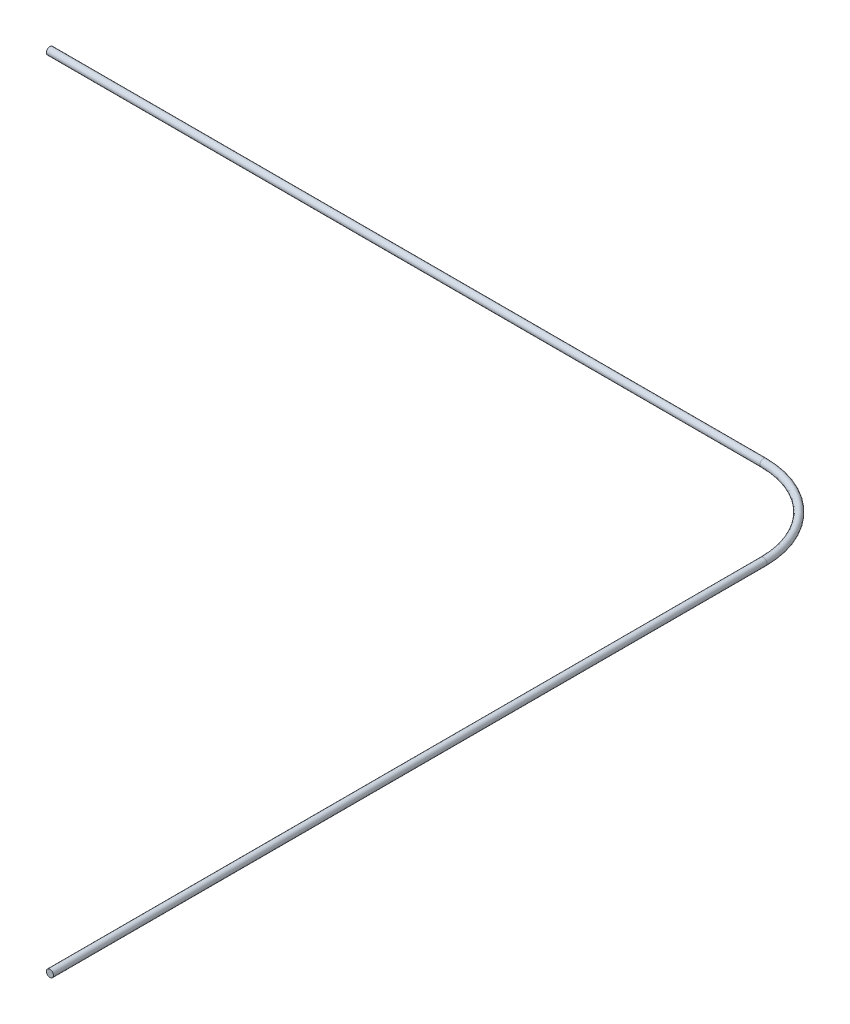
ISO-10303-21;
HEADER;
FILE_DESCRIPTION(('STEP AP214'),'2;1');
FILE_NAME('part.step','',(''),(''),'','','');
FILE_SCHEMA(('AUTOMOTIVE_DESIGN { 1 0 10303 214 1 1 1 1 }'));
ENDSEC;
DATA;
#1=APPLICATION_CONTEXT('core data for automotive mechanical design processes');
#2=APPLICATION_PROTOCOL_DEFINITION('international standard','automotive_design',2000,#1);
#3=PRODUCT_CONTEXT('',#1,'mechanical');
#4=PRODUCT('Part','Part','',(#3));
#5=PRODUCT_RELATED_PRODUCT_CATEGORY('part','',(#4));
#6=PRODUCT_DEFINITION_FORMATION('','',#4);
#7=PRODUCT_DEFINITION_CONTEXT('part definition',#1,'design');
#8=PRODUCT_DEFINITION('design','',#6,#7);
#9=PRODUCT_DEFINITION_SHAPE('','',#8);
#10=(LENGTH_UNIT() NAMED_UNIT(*) SI_UNIT(.MILLI.,.METRE.));
#11=(NAMED_UNIT(*) PLANE_ANGLE_UNIT() SI_UNIT($,.RADIAN.));
#12=(NAMED_UNIT(*) SI_UNIT($,.STERADIAN.) SOLID_ANGLE_UNIT());
#13=UNCERTAINTY_MEASURE_WITH_UNIT(LENGTH_MEASURE(1.E-05),#10,'distance_accuracy_value','');
#14=(GEOMETRIC_REPRESENTATION_CONTEXT(3) GLOBAL_UNCERTAINTY_ASSIGNED_CONTEXT((#13)) GLOBAL_UNIT_ASSIGNED_CONTEXT((#10,
#11,#12)) REPRESENTATION_CONTEXT('',''));
#15=CARTESIAN_POINT('',(0.,0.,0.));
#16=DIRECTION('',(0.,0.,1.));
#17=DIRECTION('',(1.,0.,0.));
#18=AXIS2_PLACEMENT_3D('',#15,#16,#17);
#19=CARTESIAN_POINT('',(-50.,0.,-6.));
#20=DIRECTION('',(-1.,0.,0.));
#21=DIRECTION('',(0.,0.,1.));
#22=AXIS2_PLACEMENT_3D('',#19,#20,#21);
#23=PLANE('',#22);
#24=CARTESIAN_POINT('',(-50.,0.,-6.));
#25=DIRECTION('',(-1.,0.,0.));
#26=DIRECTION('',(0.,0.,1.));
#27=AXIS2_PLACEMENT_3D('',#24,#25,#26);
#28=CIRCLE('',#27,0.25);
#29=CARTESIAN_POINT('',(-50.,0.,-5.75));
#30=VERTEX_POINT('',#29);
#31=EDGE_CURVE('E63',#30,#30,#28,.T.);
#32=ORIENTED_EDGE('',*,*,#31,.T.);
#33=EDGE_LOOP('',(#32));
#34=FACE_BOUND('',#33,.T.);
#35=ADVANCED_FACE('F47',(#34),#23,.T.);
#36=CARTESIAN_POINT('',(6.00000000000001,0.,50.));
#37=DIRECTION('',(0.,0.,-1.));
#38=DIRECTION('',(-1.,0.,0.));
#39=AXIS2_PLACEMENT_3D('',#36,#37,#38);
#40=PLANE('',#39);
#41=CARTESIAN_POINT('',(6.00000000000001,0.,50.));
#42=DIRECTION('',(0.,0.,-1.));
#43=DIRECTION('',(-1.,0.,0.));
#44=AXIS2_PLACEMENT_3D('',#41,#42,#43);
#45=CIRCLE('',#44,0.25);
#46=CARTESIAN_POINT('',(5.75000000000001,0.,50.));
#47=VERTEX_POINT('',#46);
#48=EDGE_CURVE('E11',#47,#47,#45,.T.);
#49=ORIENTED_EDGE('',*,*,#48,.F.);
#50=EDGE_LOOP('',(#49));
#51=FACE_BOUND('',#50,.T.);
#52=ADVANCED_FACE('F73',(#51),#40,.F.);
#53=CARTESIAN_POINT('',(-50.,0.,-6.));
#54=DIRECTION('',(1.,0.,0.));
#55=DIRECTION('',(0.,0.,-1.));
#56=AXIS2_PLACEMENT_3D('',#53,#54,#55);
#57=CYLINDRICAL_SURFACE('',#56,0.25);
#58=CARTESIAN_POINT('',(0.,0.,-6.));
#59=DIRECTION('',(-1.,0.,0.));
#60=DIRECTION('',(0.,0.,1.));
#61=AXIS2_PLACEMENT_3D('',#58,#59,#60);
#62=CIRCLE('',#61,0.25);
#63=CARTESIAN_POINT('',(0.,0.,-6.25));
#64=VERTEX_POINT('',#63);
#65=EDGE_CURVE('E59',#64,#64,#62,.T.);
#66=ORIENTED_EDGE('',*,*,#65,.T.);
#67=EDGE_LOOP('',(#66));
#68=FACE_BOUND('',#67,.T.);
#69=ORIENTED_EDGE('',*,*,#31,.F.);
#70=EDGE_LOOP('',(#69));
#71=FACE_BOUND('',#70,.T.);
#72=ADVANCED_FACE('F70',(#68,#71),#57,.T.);
#73=CARTESIAN_POINT('',(0.,0.,0.));
#74=DIRECTION('',(0.,-1.,0.));
#75=DIRECTION('',(0.,0.,-1.));
#76=AXIS2_PLACEMENT_3D('',#73,#74,#75);
#77=TOROIDAL_SURFACE('',#76,6.,0.25);
#78=CARTESIAN_POINT('',(6.,0.,0.));
#79=DIRECTION('',(0.,0.,-1.));
#80=DIRECTION('',(-1.,0.,0.));
#81=AXIS2_PLACEMENT_3D('',#78,#79,#80);
#82=CIRCLE('',#81,0.25);
#83=CARTESIAN_POINT('',(6.25,0.,0.));
#84=VERTEX_POINT('',#83);
#85=EDGE_CURVE('E54',#84,#84,#82,.T.);
#86=CARTESIAN_POINT('',(0.,0.,0.));
#87=DIRECTION('',(0.,-1.,0.));
#88=DIRECTION('',(0.,0.,-1.));
#89=AXIS2_PLACEMENT_3D('',#86,#87,#88);
#90=CIRCLE('',#89,6.25);
#91=EDGE_CURVE('',#64,#84,#90,.T.);
#92=ORIENTED_EDGE('',*,*,#65,.F.);
#93=ORIENTED_EDGE('',*,*,#85,.T.);
#94=ORIENTED_EDGE('',*,*,#91,.T.);
#95=ORIENTED_EDGE('',*,*,#91,.F.);
#96=EDGE_LOOP('',(#92,#94,#93,#95));
#97=FACE_BOUND('',#96,.T.);
#98=ADVANCED_FACE('F72',(#97),#77,.T.);
#99=CARTESIAN_POINT('',(6.,0.,0.));
#100=DIRECTION('',(0.,0.,1.));
#101=DIRECTION('',(1.,0.,0.));
#102=AXIS2_PLACEMENT_3D('',#99,#100,#101);
#103=CYLINDRICAL_SURFACE('',#102,0.25);
#104=ORIENTED_EDGE('',*,*,#48,.T.);
#105=EDGE_LOOP('',(#104));
#106=FACE_BOUND('',#105,.T.);
#107=ORIENTED_EDGE('',*,*,#85,.F.);
#108=EDGE_LOOP('',(#107));
#109=FACE_BOUND('',#108,.T.);
#110=ADVANCED_FACE('F80',(#106,#109),#103,.T.);
#111=CLOSED_SHELL('',(#35,#52,#72,#98,#110));
#112=MANIFOLD_SOLID_BREP('B2',#111);
#113=ADVANCED_BREP_SHAPE_REPRESENTATION('',(#18,#112),#14);
#114=SHAPE_DEFINITION_REPRESENTATION(#9,#113);
ENDSEC;
END-ISO-10303-21;
